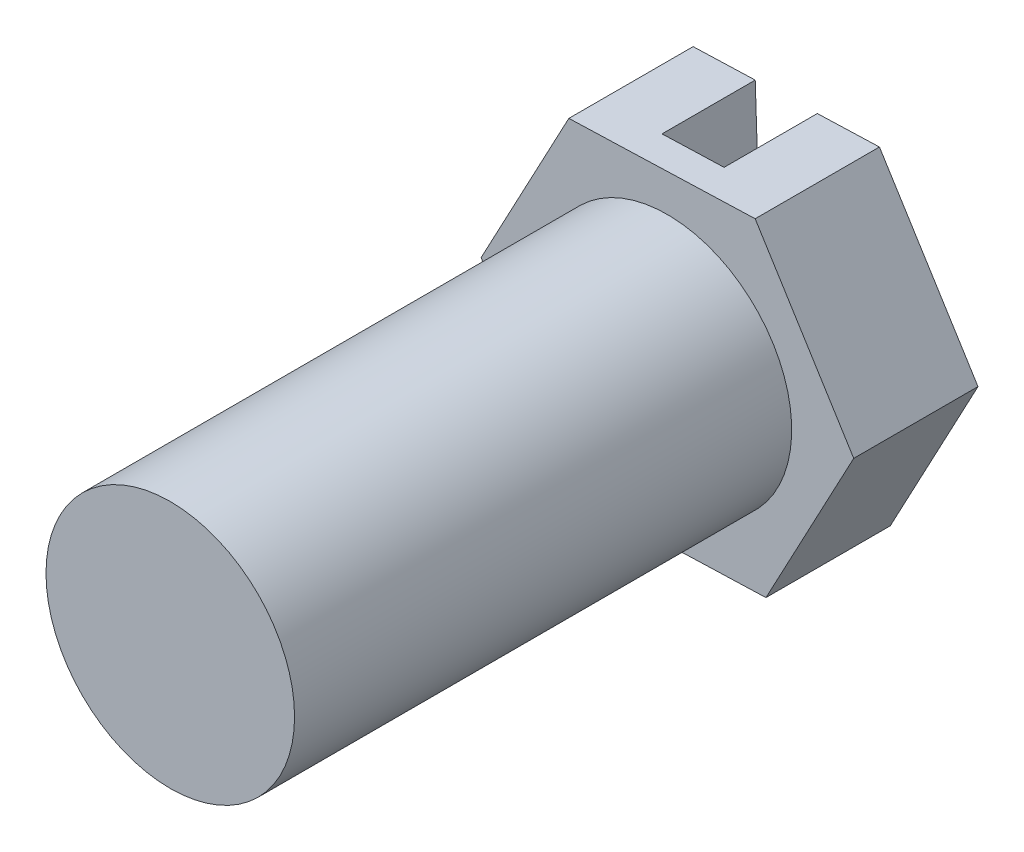
ISO-10303-21;
HEADER;
FILE_DESCRIPTION(('STEP AP214'),'2;1');
FILE_NAME('part.step','',(''),(''),'','','');
FILE_SCHEMA(('AUTOMOTIVE_DESIGN { 1 0 10303 214 1 1 1 1 }'));
ENDSEC;
DATA;
#1=APPLICATION_CONTEXT('core data for automotive mechanical design processes');
#2=APPLICATION_PROTOCOL_DEFINITION('international standard','automotive_design',2000,#1);
#3=PRODUCT_CONTEXT('',#1,'mechanical');
#4=PRODUCT('Part','Part','',(#3));
#5=PRODUCT_RELATED_PRODUCT_CATEGORY('part','',(#4));
#6=PRODUCT_DEFINITION_FORMATION('','',#4);
#7=PRODUCT_DEFINITION_CONTEXT('part definition',#1,'design');
#8=PRODUCT_DEFINITION('design','',#6,#7);
#9=PRODUCT_DEFINITION_SHAPE('','',#8);
#10=(LENGTH_UNIT() NAMED_UNIT(*) SI_UNIT(.MILLI.,.METRE.));
#11=(NAMED_UNIT(*) PLANE_ANGLE_UNIT() SI_UNIT($,.RADIAN.));
#12=(NAMED_UNIT(*) SI_UNIT($,.STERADIAN.) SOLID_ANGLE_UNIT());
#13=UNCERTAINTY_MEASURE_WITH_UNIT(LENGTH_MEASURE(1.E-05),#10,'distance_accuracy_value','');
#14=(GEOMETRIC_REPRESENTATION_CONTEXT(3) GLOBAL_UNCERTAINTY_ASSIGNED_CONTEXT((#13)) GLOBAL_UNIT_ASSIGNED_CONTEXT((#10,
#11,#12)) REPRESENTATION_CONTEXT('',''));
#15=CARTESIAN_POINT('',(0.,0.,0.));
#16=DIRECTION('',(0.,0.,1.));
#17=DIRECTION('',(1.,0.,0.));
#18=AXIS2_PLACEMENT_3D('',#15,#16,#17);
#19=CARTESIAN_POINT('',(0.158610056955949,-0.254642592337634,0.));
#20=DIRECTION('',(0.0334634748357728,-0.999439941092968,0.));
#21=DIRECTION('',(0.999439941092968,0.0334634748357728,0.));
#22=AXIS2_PLACEMENT_3D('',#19,#20,#21);
#23=PLANE('',#22);
#24=DIRECTION('',(0.999439941092968,0.0334634748357728,0.));
#25=VECTOR('',#24,1.);
#26=CARTESIAN_POINT('',(-0.0412779312626442,-0.261335287304788,-0.05));
#27=LINE('',#26,#25);
#28=CARTESIAN_POINT('',(-0.0412779312626442,-0.261335287304788,-0.05));
#29=VERTEX_POINT('',#28);
#30=CARTESIAN_POINT('',(0.0586660628466526,-0.257988939821211,-0.05));
#31=VERTEX_POINT('',#30);
#32=EDGE_CURVE('E114',#29,#31,#27,.T.);
#33=ORIENTED_EDGE('',*,*,#32,.T.);
#34=DIRECTION('',(0.,0.,-1.));
#35=VECTOR('',#34,1.);
#36=CARTESIAN_POINT('',(0.0586660628466526,-0.257988939821211,-0.05));
#37=LINE('',#36,#35);
#38=CARTESIAN_POINT('',(0.0586660628466526,-0.257988939821211,-0.2));
#39=VERTEX_POINT('',#38);
#40=EDGE_CURVE('E121',#31,#39,#37,.T.);
#41=ORIENTED_EDGE('',*,*,#40,.T.);
#42=DIRECTION('',(-0.999439941092968,-0.0334634748357728,0.));
#43=VECTOR('',#42,1.);
#44=CARTESIAN_POINT('',(0.158610056955949,-0.254642592337634,-0.2));
#45=LINE('',#44,#43);
#46=CARTESIAN_POINT('',(0.158610056955949,-0.254642592337634,-0.2));
#47=VERTEX_POINT('',#46);
#48=EDGE_CURVE('E162',#47,#39,#45,.T.);
#49=ORIENTED_EDGE('',*,*,#48,.F.);
#50=DIRECTION('',(0.,0.,-1.));
#51=VECTOR('',#50,1.);
#52=CARTESIAN_POINT('',(0.158610056955949,-0.254642592337634,0.));
#53=LINE('',#52,#51);
#54=CARTESIAN_POINT('',(0.158610056955949,-0.254642592337634,0.));
#55=VERTEX_POINT('',#54);
#56=EDGE_CURVE('E179',#55,#47,#53,.T.);
#57=ORIENTED_EDGE('',*,*,#56,.F.);
#58=DIRECTION('',(-0.999439941092968,-0.0334634748357728,0.));
#59=VECTOR('',#58,1.);
#60=CARTESIAN_POINT('',(0.158610056955949,-0.254642592337634,0.));
#61=LINE('',#60,#59);
#62=CARTESIAN_POINT('',(-0.141221925371941,-0.264681634788366,0.));
#63=VERTEX_POINT('',#62);
#64=EDGE_CURVE('E54',#55,#63,#61,.T.);
#65=ORIENTED_EDGE('',*,*,#64,.T.);
#66=DIRECTION('',(0.,0.,-1.));
#67=VECTOR('',#66,1.);
#68=CARTESIAN_POINT('',(-0.141221925371941,-0.264681634788366,0.));
#69=LINE('',#68,#67);
#70=CARTESIAN_POINT('',(-0.141221925371941,-0.264681634788366,-0.2));
#71=VERTEX_POINT('',#70);
#72=EDGE_CURVE('E161',#63,#71,#69,.T.);
#73=ORIENTED_EDGE('',*,*,#72,.T.);
#74=CARTESIAN_POINT('',(-0.0412779312626442,-0.261335287304788,-0.2));
#75=VERTEX_POINT('',#74);
#76=EDGE_CURVE('E127',#75,#71,#45,.T.);
#77=ORIENTED_EDGE('',*,*,#76,.F.);
#78=DIRECTION('',(0.,0.,-1.));
#79=VECTOR('',#78,1.);
#80=CARTESIAN_POINT('',(-0.0412779312626442,-0.261335287304788,-0.05));
#81=LINE('',#80,#79);
#82=EDGE_CURVE('E46',#29,#75,#81,.T.);
#83=ORIENTED_EDGE('',*,*,#82,.F.);
#84=EDGE_LOOP('',(#33,#41,#49,#57,#65,#73,#77,#83));
#85=FACE_BOUND('',#84,.T.);
#86=ADVANCED_FACE('F31',(#85),#23,.T.);
#87=CARTESIAN_POINT('',(-0.158610056955949,0.254642592337634,0.));
#88=DIRECTION('',(-0.0334634748357728,0.999439941092968,0.));
#89=DIRECTION('',(-0.999439941092968,-0.0334634748357728,0.));
#90=AXIS2_PLACEMENT_3D('',#87,#88,#89);
#91=PLANE('',#90);
#92=DIRECTION('',(0.999439941092968,0.0334634748357728,0.));
#93=VECTOR('',#92,1.);
#94=CARTESIAN_POINT('',(-0.158610056955949,0.254642592337634,-0.2));
#95=LINE('',#94,#93);
#96=CARTESIAN_POINT('',(0.0412779312626443,0.261335287304789,-0.2));
#97=VERTEX_POINT('',#96);
#98=CARTESIAN_POINT('',(0.141221925371941,0.264681634788366,-0.2));
#99=VERTEX_POINT('',#98);
#100=EDGE_CURVE('E170',#97,#99,#95,.T.);
#101=ORIENTED_EDGE('',*,*,#100,.F.);
#102=DIRECTION('',(0.,0.,-1.));
#103=VECTOR('',#102,1.);
#104=CARTESIAN_POINT('',(0.0412779312626443,0.261335287304789,-0.05));
#105=LINE('',#104,#103);
#106=CARTESIAN_POINT('',(0.0412779312626443,0.261335287304789,-0.05));
#107=VERTEX_POINT('',#106);
#108=EDGE_CURVE('E128',#107,#97,#105,.T.);
#109=ORIENTED_EDGE('',*,*,#108,.F.);
#110=DIRECTION('',(-0.999439941092968,-0.0334634748357728,0.));
#111=VECTOR('',#110,1.);
#112=CARTESIAN_POINT('',(0.0412779312626443,0.261335287304789,-0.05));
#113=LINE('',#112,#111);
#114=CARTESIAN_POINT('',(-0.0586660628466525,0.257988939821211,-0.05));
#115=VERTEX_POINT('',#114);
#116=EDGE_CURVE('E116',#107,#115,#113,.T.);
#117=ORIENTED_EDGE('',*,*,#116,.T.);
#118=DIRECTION('',(0.,0.,-1.));
#119=VECTOR('',#118,1.);
#120=CARTESIAN_POINT('',(-0.0586660628466525,0.257988939821211,-0.05));
#121=LINE('',#120,#119);
#122=CARTESIAN_POINT('',(-0.0586660628466525,0.257988939821211,-0.2));
#123=VERTEX_POINT('',#122);
#124=EDGE_CURVE('E140',#115,#123,#121,.T.);
#125=ORIENTED_EDGE('',*,*,#124,.T.);
#126=CARTESIAN_POINT('',(-0.158610056955949,0.254642592337634,-0.2));
#127=VERTEX_POINT('',#126);
#128=EDGE_CURVE('E171',#127,#123,#95,.T.);
#129=ORIENTED_EDGE('',*,*,#128,.F.);
#130=DIRECTION('',(0.,0.,-1.));
#131=VECTOR('',#130,1.);
#132=CARTESIAN_POINT('',(-0.158610056955949,0.254642592337634,0.));
#133=LINE('',#132,#131);
#134=CARTESIAN_POINT('',(-0.158610056955949,0.254642592337634,0.));
#135=VERTEX_POINT('',#134);
#136=EDGE_CURVE('E186',#135,#127,#133,.T.);
#137=ORIENTED_EDGE('',*,*,#136,.F.);
#138=DIRECTION('',(0.999439941092968,0.0334634748357728,0.));
#139=VECTOR('',#138,1.);
#140=CARTESIAN_POINT('',(-0.158610056955949,0.254642592337634,0.));
#141=LINE('',#140,#139);
#142=CARTESIAN_POINT('',(0.141221925371941,0.264681634788366,0.));
#143=VERTEX_POINT('',#142);
#144=EDGE_CURVE('E152',#135,#143,#141,.T.);
#145=ORIENTED_EDGE('',*,*,#144,.T.);
#146=DIRECTION('',(0.,0.,-1.));
#147=VECTOR('',#146,1.);
#148=CARTESIAN_POINT('',(0.141221925371941,0.264681634788366,0.));
#149=LINE('',#148,#147);
#150=EDGE_CURVE('E183',#143,#99,#149,.T.);
#151=ORIENTED_EDGE('',*,*,#150,.T.);
#152=EDGE_LOOP('',(#101,#109,#117,#125,#129,#137,#145,#151));
#153=FACE_BOUND('',#152,.T.);
#154=ADVANCED_FACE('F210',(#153),#91,.T.);
#155=CARTESIAN_POINT('',(0.,0.,-0.2));
#156=DIRECTION('',(0.,0.,-1.));
#157=DIRECTION('',(-1.,0.,0.));
#158=AXIS2_PLACEMENT_3D('',#155,#156,#157);
#159=PLANE('',#158);
#160=ORIENTED_EDGE('',*,*,#48,.T.);
#161=DIRECTION('',(-0.0334634748357727,0.999439941092968,0.));
#162=VECTOR('',#161,1.);
#163=CARTESIAN_POINT('',(0.0586660628466526,-0.257988939821211,-0.2));
#164=LINE('',#163,#162);
#165=EDGE_CURVE('E124',#39,#97,#164,.T.);
#166=ORIENTED_EDGE('',*,*,#165,.T.);
#167=ORIENTED_EDGE('',*,*,#100,.T.);
#168=DIRECTION('',(0.528700189853164,-0.848808641125447,0.));
#169=VECTOR('',#168,1.);
#170=CARTESIAN_POINT('',(0.141221925371941,0.264681634788366,-0.2));
#171=LINE('',#170,#169);
#172=CARTESIAN_POINT('',(0.29983198232789,0.0100390424507318,-0.2));
#173=VERTEX_POINT('',#172);
#174=EDGE_CURVE('E174',#99,#173,#171,.T.);
#175=ORIENTED_EDGE('',*,*,#174,.T.);
#176=DIRECTION('',(-0.470739751239804,-0.88227211596122,0.));
#177=VECTOR('',#176,1.);
#178=CARTESIAN_POINT('',(0.29983198232789,0.0100390424507318,-0.2));
#179=LINE('',#178,#177);
#180=EDGE_CURVE('E146',#173,#47,#179,.T.);
#181=ORIENTED_EDGE('',*,*,#180,.T.);
#182=EDGE_LOOP('',(#160,#166,#167,#175,#181));
#183=FACE_BOUND('',#182,.T.);
#184=ADVANCED_FACE('F206',(#183),#159,.T.);
#185=CARTESIAN_POINT('',(0.,0.,0.));
#186=DIRECTION('',(0.,0.,-1.));
#187=DIRECTION('',(-1.,0.,0.));
#188=AXIS2_PLACEMENT_3D('',#185,#186,#187);
#189=PLANE('',#188);
#190=CARTESIAN_POINT('',(0.,0.,0.));
#191=DIRECTION('',(0.,0.,-1.));
#192=DIRECTION('',(-1.,0.,0.));
#193=AXIS2_PLACEMENT_3D('',#190,#191,#192);
#194=CIRCLE('',#193,0.2);
#195=CARTESIAN_POINT('',(-0.2,0.,0.));
#196=VERTEX_POINT('',#195);
#197=EDGE_CURVE('E39',#196,#196,#194,.T.);
#198=ORIENTED_EDGE('',*,*,#197,.T.);
#199=EDGE_LOOP('',(#198));
#200=FACE_BOUND('',#199,.T.);
#201=ORIENTED_EDGE('',*,*,#64,.F.);
#202=DIRECTION('',(-0.470739751239804,-0.88227211596122,0.));
#203=VECTOR('',#202,1.);
#204=CARTESIAN_POINT('',(0.29983198232789,0.0100390424507318,0.));
#205=LINE('',#204,#203);
#206=CARTESIAN_POINT('',(0.29983198232789,0.0100390424507318,0.));
#207=VERTEX_POINT('',#206);
#208=EDGE_CURVE('E158',#207,#55,#205,.T.);
#209=ORIENTED_EDGE('',*,*,#208,.F.);
#210=DIRECTION('',(0.528700189853164,-0.848808641125447,0.));
#211=VECTOR('',#210,1.);
#212=CARTESIAN_POINT('',(0.141221925371941,0.264681634788366,0.));
#213=LINE('',#212,#211);
#214=EDGE_CURVE('E155',#143,#207,#213,.T.);
#215=ORIENTED_EDGE('',*,*,#214,.F.);
#216=ORIENTED_EDGE('',*,*,#144,.F.);
#217=DIRECTION('',(0.470739751239804,0.88227211596122,0.));
#218=VECTOR('',#217,1.);
#219=CARTESIAN_POINT('',(-0.29983198232789,-0.0100390424507317,0.));
#220=LINE('',#219,#218);
#221=CARTESIAN_POINT('',(-0.29983198232789,-0.0100390424507317,0.));
#222=VERTEX_POINT('',#221);
#223=EDGE_CURVE('E149',#222,#135,#220,.T.);
#224=ORIENTED_EDGE('',*,*,#223,.F.);
#225=DIRECTION('',(-0.528700189853164,0.848808641125447,0.));
#226=VECTOR('',#225,1.);
#227=CARTESIAN_POINT('',(-0.141221925371941,-0.264681634788366,0.));
#228=LINE('',#227,#226);
#229=EDGE_CURVE('E145',#63,#222,#228,.T.);
#230=ORIENTED_EDGE('',*,*,#229,.F.);
#231=EDGE_LOOP('',(#201,#209,#215,#216,#224,#230));
#232=FACE_BOUND('',#231,.T.);
#233=ADVANCED_FACE('F194',(#200,#232),#189,.F.);
#234=CARTESIAN_POINT('',(0.,0.,0.8));
#235=DIRECTION('',(0.,0.,-1.));
#236=DIRECTION('',(-1.,0.,0.));
#237=AXIS2_PLACEMENT_3D('',#234,#235,#236);
#238=CYLINDRICAL_SURFACE('',#237,0.2);
#239=CARTESIAN_POINT('',(0.,0.,0.8));
#240=DIRECTION('',(0.,0.,1.));
#241=DIRECTION('',(1.,0.,0.));
#242=AXIS2_PLACEMENT_3D('',#239,#240,#241);
#243=CIRCLE('',#242,0.2);
#244=CARTESIAN_POINT('',(0.2,0.,0.8));
#245=VERTEX_POINT('',#244);
#246=EDGE_CURVE('E11',#245,#245,#243,.T.);
#247=ORIENTED_EDGE('',*,*,#246,.F.);
#248=EDGE_LOOP('',(#247));
#249=FACE_BOUND('',#248,.T.);
#250=ORIENTED_EDGE('',*,*,#197,.F.);
#251=EDGE_LOOP('',(#250));
#252=FACE_BOUND('',#251,.T.);
#253=ADVANCED_FACE('F33',(#249,#252),#238,.T.);
#254=CARTESIAN_POINT('',(0.,0.,0.8));
#255=DIRECTION('',(0.,0.,1.));
#256=DIRECTION('',(1.,0.,0.));
#257=AXIS2_PLACEMENT_3D('',#254,#255,#256);
#258=PLANE('',#257);
#259=ORIENTED_EDGE('',*,*,#246,.T.);
#260=EDGE_LOOP('',(#259));
#261=FACE_BOUND('',#260,.T.);
#262=ADVANCED_FACE('F198',(#261),#258,.T.);
#263=CARTESIAN_POINT('',(0.29983198232789,0.0100390424507318,0.));
#264=DIRECTION('',(0.882272115961219,-0.470739751239804,0.));
#265=DIRECTION('',(0.470739751239804,0.88227211596122,0.));
#266=AXIS2_PLACEMENT_3D('',#263,#264,#265);
#267=PLANE('',#266);
#268=ORIENTED_EDGE('',*,*,#180,.F.);
#269=DIRECTION('',(0.,0.,-1.));
#270=VECTOR('',#269,1.);
#271=CARTESIAN_POINT('',(0.29983198232789,0.0100390424507318,0.));
#272=LINE('',#271,#270);
#273=EDGE_CURVE('E181',#207,#173,#272,.T.);
#274=ORIENTED_EDGE('',*,*,#273,.F.);
#275=ORIENTED_EDGE('',*,*,#208,.T.);
#276=ORIENTED_EDGE('',*,*,#56,.T.);
#277=EDGE_LOOP('',(#268,#274,#275,#276));
#278=FACE_BOUND('',#277,.T.);
#279=ADVANCED_FACE('F204',(#278),#267,.T.);
#280=CARTESIAN_POINT('',(0.141221925371941,0.264681634788366,0.));
#281=DIRECTION('',(0.848808641125447,0.528700189853164,0.));
#282=DIRECTION('',(-0.528700189853164,0.848808641125447,0.));
#283=AXIS2_PLACEMENT_3D('',#280,#281,#282);
#284=PLANE('',#283);
#285=ORIENTED_EDGE('',*,*,#174,.F.);
#286=ORIENTED_EDGE('',*,*,#150,.F.);
#287=ORIENTED_EDGE('',*,*,#214,.T.);
#288=ORIENTED_EDGE('',*,*,#273,.T.);
#289=EDGE_LOOP('',(#285,#286,#287,#288));
#290=FACE_BOUND('',#289,.T.);
#291=ADVANCED_FACE('F248',(#290),#284,.T.);
#292=CARTESIAN_POINT('',(-0.29983198232789,-0.0100390424507317,0.));
#293=DIRECTION('',(-0.88227211596122,0.470739751239804,0.));
#294=DIRECTION('',(-0.470739751239804,-0.88227211596122,0.));
#295=AXIS2_PLACEMENT_3D('',#292,#293,#294);
#296=PLANE('',#295);
#297=DIRECTION('',(0.470739751239804,0.88227211596122,0.));
#298=VECTOR('',#297,1.);
#299=CARTESIAN_POINT('',(-0.29983198232789,-0.0100390424507317,-0.2));
#300=LINE('',#299,#298);
#301=CARTESIAN_POINT('',(-0.29983198232789,-0.0100390424507313,-0.2));
#302=VERTEX_POINT('',#301);
#303=EDGE_CURVE('E167',#302,#127,#300,.T.);
#304=ORIENTED_EDGE('',*,*,#303,.F.);
#305=DIRECTION('',(0.,0.,-1.));
#306=VECTOR('',#305,1.);
#307=CARTESIAN_POINT('',(-0.29983198232789,-0.0100390424507317,0.));
#308=LINE('',#307,#306);
#309=EDGE_CURVE('E188',#222,#302,#308,.T.);
#310=ORIENTED_EDGE('',*,*,#309,.F.);
#311=ORIENTED_EDGE('',*,*,#223,.T.);
#312=ORIENTED_EDGE('',*,*,#136,.T.);
#313=EDGE_LOOP('',(#304,#310,#311,#312));
#314=FACE_BOUND('',#313,.T.);
#315=ADVANCED_FACE('F230',(#314),#296,.T.);
#316=CARTESIAN_POINT('',(-0.141221925371941,-0.264681634788366,0.));
#317=DIRECTION('',(-0.848808641125447,-0.528700189853164,0.));
#318=DIRECTION('',(0.528700189853164,-0.848808641125447,0.));
#319=AXIS2_PLACEMENT_3D('',#316,#317,#318);
#320=PLANE('',#319);
#321=DIRECTION('',(-0.528700189853164,0.848808641125447,0.));
#322=VECTOR('',#321,1.);
#323=CARTESIAN_POINT('',(-0.141221925371941,-0.264681634788366,-0.2));
#324=LINE('',#323,#322);
#325=EDGE_CURVE('E164',#71,#302,#324,.T.);
#326=ORIENTED_EDGE('',*,*,#325,.F.);
#327=ORIENTED_EDGE('',*,*,#72,.F.);
#328=ORIENTED_EDGE('',*,*,#229,.T.);
#329=ORIENTED_EDGE('',*,*,#309,.T.);
#330=EDGE_LOOP('',(#326,#327,#328,#329));
#331=FACE_BOUND('',#330,.T.);
#332=ADVANCED_FACE('F219',(#331),#320,.T.);
#333=DIRECTION('',(-0.0334634748357727,0.999439941092968,0.));
#334=VECTOR('',#333,1.);
#335=CARTESIAN_POINT('',(-0.0412779312626442,-0.261335287304788,-0.2));
#336=LINE('',#335,#334);
#337=EDGE_CURVE('E131',#75,#123,#336,.T.);
#338=ORIENTED_EDGE('',*,*,#337,.F.);
#339=ORIENTED_EDGE('',*,*,#76,.T.);
#340=ORIENTED_EDGE('',*,*,#325,.T.);
#341=ORIENTED_EDGE('',*,*,#303,.T.);
#342=ORIENTED_EDGE('',*,*,#128,.T.);
#343=EDGE_LOOP('',(#338,#339,#340,#341,#342));
#344=FACE_BOUND('',#343,.T.);
#345=ADVANCED_FACE('F221',(#344),#159,.T.);
#346=CARTESIAN_POINT('',(0.0586660628466526,-0.257988939821211,-0.05));
#347=DIRECTION('',(-0.999439941092968,-0.0334634748357727,0.));
#348=DIRECTION('',(0.0334634748357727,-0.999439941092968,0.));
#349=AXIS2_PLACEMENT_3D('',#346,#347,#348);
#350=PLANE('',#349);
#351=ORIENTED_EDGE('',*,*,#165,.F.);
#352=ORIENTED_EDGE('',*,*,#40,.F.);
#353=DIRECTION('',(-0.0334634748357727,0.999439941092968,0.));
#354=VECTOR('',#353,1.);
#355=CARTESIAN_POINT('',(0.0586660628466526,-0.257988939821211,-0.05));
#356=LINE('',#355,#354);
#357=EDGE_CURVE('E109',#31,#107,#356,.T.);
#358=ORIENTED_EDGE('',*,*,#357,.T.);
#359=ORIENTED_EDGE('',*,*,#108,.T.);
#360=EDGE_LOOP('',(#351,#352,#358,#359));
#361=FACE_BOUND('',#360,.T.);
#362=ADVANCED_FACE('F122',(#361),#350,.T.);
#363=CARTESIAN_POINT('',(-0.0412779312626442,-0.261335287304788,-0.05));
#364=DIRECTION('',(-0.999439941092968,-0.0334634748357727,0.));
#365=DIRECTION('',(0.0334634748357727,-0.999439941092968,0.));
#366=AXIS2_PLACEMENT_3D('',#363,#364,#365);
#367=PLANE('',#366);
#368=ORIENTED_EDGE('',*,*,#337,.T.);
#369=ORIENTED_EDGE('',*,*,#124,.F.);
#370=DIRECTION('',(-0.0334634748357727,0.999439941092968,0.));
#371=VECTOR('',#370,1.);
#372=CARTESIAN_POINT('',(-0.0412779312626442,-0.261335287304788,-0.05));
#373=LINE('',#372,#371);
#374=EDGE_CURVE('E136',#29,#115,#373,.T.);
#375=ORIENTED_EDGE('',*,*,#374,.F.);
#376=ORIENTED_EDGE('',*,*,#82,.T.);
#377=EDGE_LOOP('',(#368,#369,#375,#376));
#378=FACE_BOUND('',#377,.T.);
#379=ADVANCED_FACE('F228',(#378),#367,.F.);
#380=CARTESIAN_POINT('',(0.0586660628466526,-0.257988939821211,-0.05));
#381=DIRECTION('',(0.,0.,1.));
#382=DIRECTION('',(1.,0.,0.));
#383=AXIS2_PLACEMENT_3D('',#380,#381,#382);
#384=PLANE('',#383);
#385=ORIENTED_EDGE('',*,*,#32,.F.);
#386=ORIENTED_EDGE('',*,*,#374,.T.);
#387=ORIENTED_EDGE('',*,*,#116,.F.);
#388=ORIENTED_EDGE('',*,*,#357,.F.);
#389=EDGE_LOOP('',(#385,#386,#387,#388));
#390=FACE_BOUND('',#389,.T.);
#391=ADVANCED_FACE('F111',(#390),#384,.F.);
#392=CLOSED_SHELL('',(#86,#154,#184,#233,#253,#262,#279,#291,#315,#332,#345,#362,#379,#391));
#393=MANIFOLD_SOLID_BREP('B2',#392);
#394=ADVANCED_BREP_SHAPE_REPRESENTATION('',(#18,#393),#14);
#395=SHAPE_DEFINITION_REPRESENTATION(#9,#394);
ENDSEC;
END-ISO-10303-21;
